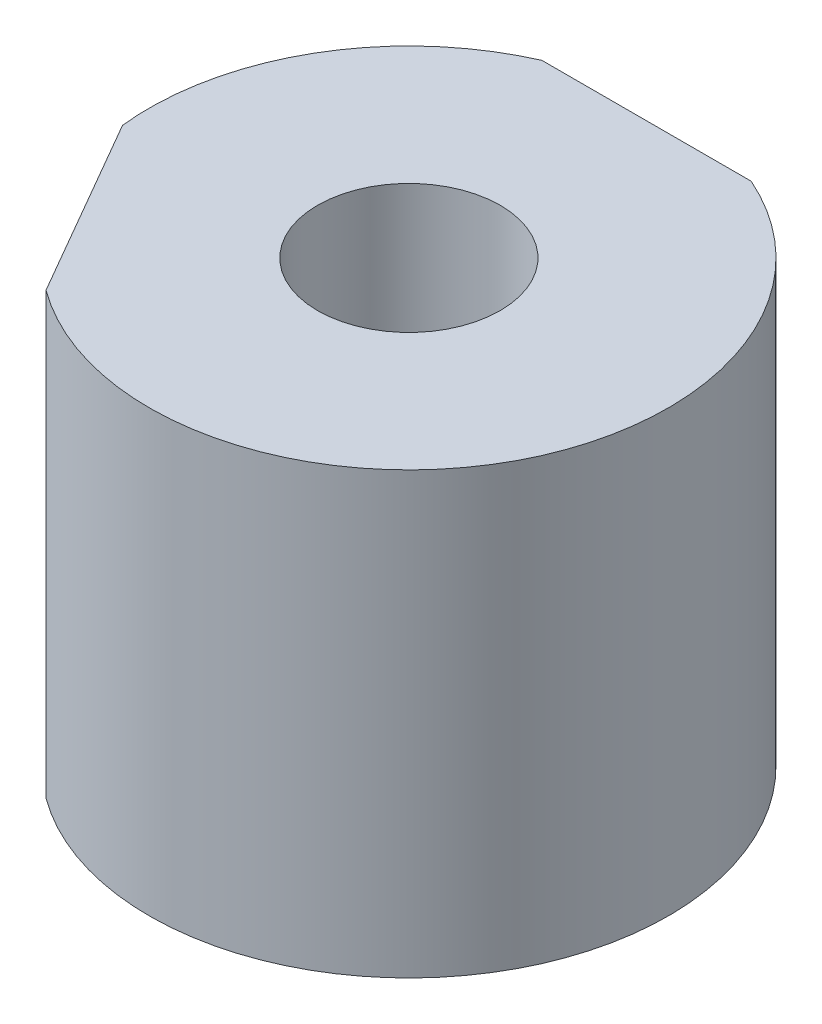
ISO-10303-21;
HEADER;
FILE_DESCRIPTION(('STEP AP214'),'2;1');
FILE_NAME('part.step','',(''),(''),'','','');
FILE_SCHEMA(('AUTOMOTIVE_DESIGN { 1 0 10303 214 1 1 1 1 }'));
ENDSEC;
DATA;
#1=APPLICATION_CONTEXT('core data for automotive mechanical design processes');
#2=APPLICATION_PROTOCOL_DEFINITION('international standard','automotive_design',2000,#1);
#3=PRODUCT_CONTEXT('',#1,'mechanical');
#4=PRODUCT('Part','Part','',(#3));
#5=PRODUCT_RELATED_PRODUCT_CATEGORY('part','',(#4));
#6=PRODUCT_DEFINITION_FORMATION('','',#4);
#7=PRODUCT_DEFINITION_CONTEXT('part definition',#1,'design');
#8=PRODUCT_DEFINITION('design','',#6,#7);
#9=PRODUCT_DEFINITION_SHAPE('','',#8);
#10=(LENGTH_UNIT() NAMED_UNIT(*) SI_UNIT(.MILLI.,.METRE.));
#11=(NAMED_UNIT(*) PLANE_ANGLE_UNIT() SI_UNIT($,.RADIAN.));
#12=(NAMED_UNIT(*) SI_UNIT($,.STERADIAN.) SOLID_ANGLE_UNIT());
#13=UNCERTAINTY_MEASURE_WITH_UNIT(LENGTH_MEASURE(1.E-05),#10,'distance_accuracy_value','');
#14=(GEOMETRIC_REPRESENTATION_CONTEXT(3) GLOBAL_UNCERTAINTY_ASSIGNED_CONTEXT((#13)) GLOBAL_UNIT_ASSIGNED_CONTEXT((#10,
#11,#12)) REPRESENTATION_CONTEXT('',''));
#15=CARTESIAN_POINT('',(0.,0.,0.));
#16=DIRECTION('',(0.,0.,1.));
#17=DIRECTION('',(1.,0.,0.));
#18=AXIS2_PLACEMENT_3D('',#15,#16,#17);
#19=CARTESIAN_POINT('',(0.,10.,0.));
#20=DIRECTION('',(0.,-1.,0.));
#21=DIRECTION('',(0.,0.,-1.));
#22=AXIS2_PLACEMENT_3D('',#19,#20,#21);
#23=CYLINDRICAL_SURFACE('',#22,5.9);
#24=CARTESIAN_POINT('',(0.,10.,0.));
#25=DIRECTION('',(0.,1.,0.));
#26=DIRECTION('',(0.,0.,1.));
#27=AXIS2_PLACEMENT_3D('',#24,#25,#26);
#28=CIRCLE('',#27,5.9);
#29=CARTESIAN_POINT('',(-3.48805074803548,10.,4.7585188850239));
#30=VERTEX_POINT('',#29);
#31=CARTESIAN_POINT('',(2.37697286480094,10.,-5.4));
#32=VERTEX_POINT('',#31);
#33=EDGE_CURVE('E84',#30,#32,#28,.T.);
#34=ORIENTED_EDGE('',*,*,#33,.F.);
#35=DIRECTION('',(0.,-1.,0.));
#36=VECTOR('',#35,1.);
#37=CARTESIAN_POINT('',(-3.48805074803548,10.,4.75851888502391));
#38=LINE('',#37,#36);
#39=CARTESIAN_POINT('',(-3.48805074803548,0.,4.7585188850239));
#40=VERTEX_POINT('',#39);
#41=EDGE_CURVE('E72',#30,#40,#38,.T.);
#42=ORIENTED_EDGE('',*,*,#41,.T.);
#43=CARTESIAN_POINT('',(0.,0.,0.));
#44=DIRECTION('',(0.,1.,0.));
#45=DIRECTION('',(0.,0.,1.));
#46=AXIS2_PLACEMENT_3D('',#43,#44,#45);
#47=CIRCLE('',#46,5.9);
#48=CARTESIAN_POINT('',(2.37697286480094,0.,-5.4));
#49=VERTEX_POINT('',#48);
#50=EDGE_CURVE('E55',#40,#49,#47,.T.);
#51=ORIENTED_EDGE('',*,*,#50,.T.);
#52=DIRECTION('',(0.,-1.,0.));
#53=VECTOR('',#52,1.);
#54=CARTESIAN_POINT('',(2.37697286480094,10.,-5.4));
#55=LINE('',#54,#53);
#56=EDGE_CURVE('E89',#49,#32,#55,.F.);
#57=ORIENTED_EDGE('',*,*,#56,.T.);
#58=EDGE_LOOP('',(#34,#42,#51,#57));
#59=FACE_BOUND('',#58,.T.);
#60=ADVANCED_FACE('F33',(#59),#23,.T.);
#61=CARTESIAN_POINT('',(-2.37697286480094,0.,-5.4));
#62=VERTEX_POINT('',#61);
#63=CARTESIAN_POINT('',(-5.86502361283644,0.,0.64148111497614));
#64=VERTEX_POINT('',#63);
#65=EDGE_CURVE('E90',#62,#64,#47,.T.);
#66=ORIENTED_EDGE('',*,*,#65,.T.);
#67=DIRECTION('',(0.,-1.,0.));
#68=VECTOR('',#67,1.);
#69=CARTESIAN_POINT('',(-5.86502361283644,10.,0.641481114976138));
#70=LINE('',#69,#68);
#71=CARTESIAN_POINT('',(-5.86502361283644,10.,0.641481114976136));
#72=VERTEX_POINT('',#71);
#73=EDGE_CURVE('E48',#64,#72,#70,.F.);
#74=ORIENTED_EDGE('',*,*,#73,.T.);
#75=CARTESIAN_POINT('',(-2.37697286480094,10.,-5.4));
#76=VERTEX_POINT('',#75);
#77=EDGE_CURVE('E87',#76,#72,#28,.T.);
#78=ORIENTED_EDGE('',*,*,#77,.F.);
#79=DIRECTION('',(0.,-1.,0.));
#80=VECTOR('',#79,1.);
#81=CARTESIAN_POINT('',(-2.37697286480094,10.,-5.4));
#82=LINE('',#81,#80);
#83=EDGE_CURVE('E104',#76,#62,#82,.T.);
#84=ORIENTED_EDGE('',*,*,#83,.T.);
#85=EDGE_LOOP('',(#66,#74,#78,#84));
#86=FACE_BOUND('',#85,.T.);
#87=ADVANCED_FACE('F35',(#86),#23,.T.);
#88=CARTESIAN_POINT('',(0.,10.,0.));
#89=DIRECTION('',(0.,1.,0.));
#90=DIRECTION('',(0.,0.,1.));
#91=AXIS2_PLACEMENT_3D('',#88,#89,#90);
#92=PLANE('',#91);
#93=DIRECTION('',(-0.500000000000004,0.,-0.866025403784436));
#94=VECTOR('',#93,1.);
#95=CARTESIAN_POINT('',(-1.72653718043593,10.,7.8095498823282));
#96=LINE('',#95,#94);
#97=EDGE_CURVE('E75',#30,#72,#96,.T.);
#98=ORIENTED_EDGE('',*,*,#97,.F.);
#99=ORIENTED_EDGE('',*,*,#33,.T.);
#100=DIRECTION('',(1.,0.,0.));
#101=VECTOR('',#100,1.);
#102=CARTESIAN_POINT('',(-5.9,10.,-5.4));
#103=LINE('',#102,#101);
#104=EDGE_CURVE('E77',#76,#32,#103,.T.);
#105=ORIENTED_EDGE('',*,*,#104,.F.);
#106=ORIENTED_EDGE('',*,*,#77,.T.);
#107=EDGE_LOOP('',(#98,#99,#105,#106));
#108=FACE_BOUND('',#107,.T.);
#109=CARTESIAN_POINT('',(0.,10.,0.));
#110=DIRECTION('',(0.,1.,0.));
#111=DIRECTION('',(0.,0.,1.));
#112=AXIS2_PLACEMENT_3D('',#109,#110,#111);
#113=CIRCLE('',#112,2.075);
#114=CARTESIAN_POINT('',(0.,10.,2.075));
#115=VERTEX_POINT('',#114);
#116=EDGE_CURVE('E95',#115,#115,#113,.T.);
#117=ORIENTED_EDGE('',*,*,#116,.F.);
#118=EDGE_LOOP('',(#117));
#119=FACE_BOUND('',#118,.T.);
#120=ADVANCED_FACE('F81',(#108,#119),#92,.T.);
#121=CARTESIAN_POINT('',(0.,0.,0.));
#122=DIRECTION('',(0.,1.,0.));
#123=DIRECTION('',(0.,0.,1.));
#124=AXIS2_PLACEMENT_3D('',#121,#122,#123);
#125=PLANE('',#124);
#126=CARTESIAN_POINT('',(0.,0.,0.));
#127=DIRECTION('',(0.,1.,0.));
#128=DIRECTION('',(0.,0.,1.));
#129=AXIS2_PLACEMENT_3D('',#126,#127,#128);
#130=CIRCLE('',#129,2.075);
#131=CARTESIAN_POINT('',(0.,0.,2.075));
#132=VERTEX_POINT('',#131);
#133=EDGE_CURVE('E108',#132,#132,#130,.T.);
#134=ORIENTED_EDGE('',*,*,#133,.T.);
#135=EDGE_LOOP('',(#134));
#136=FACE_BOUND('',#135,.T.);
#137=ORIENTED_EDGE('',*,*,#50,.F.);
#138=DIRECTION('',(-0.500000000000004,0.,-0.866025403784436));
#139=VECTOR('',#138,1.);
#140=CARTESIAN_POINT('',(-4.67653718043596,0.,2.70000000000002));
#141=LINE('',#140,#139);
#142=EDGE_CURVE('E11',#40,#64,#141,.T.);
#143=ORIENTED_EDGE('',*,*,#142,.T.);
#144=ORIENTED_EDGE('',*,*,#65,.F.);
#145=DIRECTION('',(1.,0.,0.));
#146=VECTOR('',#145,1.);
#147=CARTESIAN_POINT('',(0.,0.,-5.4));
#148=LINE('',#147,#146);
#149=EDGE_CURVE('E41',#62,#49,#148,.T.);
#150=ORIENTED_EDGE('',*,*,#149,.T.);
#151=EDGE_LOOP('',(#137,#143,#144,#150));
#152=FACE_BOUND('',#151,.T.);
#153=ADVANCED_FACE('F100',(#136,#152),#125,.F.);
#154=CARTESIAN_POINT('',(0.,0.,0.));
#155=DIRECTION('',(0.,1.,0.));
#156=DIRECTION('',(0.,0.,1.));
#157=AXIS2_PLACEMENT_3D('',#154,#155,#156);
#158=CYLINDRICAL_SURFACE('',#157,2.075);
#159=ORIENTED_EDGE('',*,*,#133,.F.);
#160=EDGE_LOOP('',(#159));
#161=FACE_BOUND('',#160,.T.);
#162=ORIENTED_EDGE('',*,*,#116,.T.);
#163=EDGE_LOOP('',(#162));
#164=FACE_BOUND('',#163,.T.);
#165=ADVANCED_FACE('F115',(#161,#164),#158,.F.);
#166=CARTESIAN_POINT('',(-5.9,0.,-5.4));
#167=DIRECTION('',(0.,0.,1.));
#168=DIRECTION('',(1.,0.,0.));
#169=AXIS2_PLACEMENT_3D('',#166,#167,#168);
#170=PLANE('',#169);
#171=ORIENTED_EDGE('',*,*,#104,.T.);
#172=ORIENTED_EDGE('',*,*,#56,.F.);
#173=ORIENTED_EDGE('',*,*,#149,.F.);
#174=ORIENTED_EDGE('',*,*,#83,.F.);
#175=EDGE_LOOP('',(#171,#172,#173,#174));
#176=FACE_BOUND('',#175,.T.);
#177=ADVANCED_FACE('F103',(#176),#170,.F.);
#178=CARTESIAN_POINT('',(-1.72653718043593,0.,7.8095498823282));
#179=DIRECTION('',(0.866025403784436,0.,-0.500000000000004));
#180=DIRECTION('',(-0.500000000000004,0.,-0.866025403784436));
#181=AXIS2_PLACEMENT_3D('',#178,#179,#180);
#182=PLANE('',#181);
#183=ORIENTED_EDGE('',*,*,#97,.T.);
#184=ORIENTED_EDGE('',*,*,#73,.F.);
#185=ORIENTED_EDGE('',*,*,#142,.F.);
#186=ORIENTED_EDGE('',*,*,#41,.F.);
#187=EDGE_LOOP('',(#183,#184,#185,#186));
#188=FACE_BOUND('',#187,.T.);
#189=ADVANCED_FACE('F74',(#188),#182,.F.);
#190=CLOSED_SHELL('',(#60,#87,#120,#153,#165,#177,#189));
#191=MANIFOLD_SOLID_BREP('B2',#190);
#192=ADVANCED_BREP_SHAPE_REPRESENTATION('',(#18,#191),#14);
#193=SHAPE_DEFINITION_REPRESENTATION(#9,#192);
ENDSEC;
END-ISO-10303-21;
